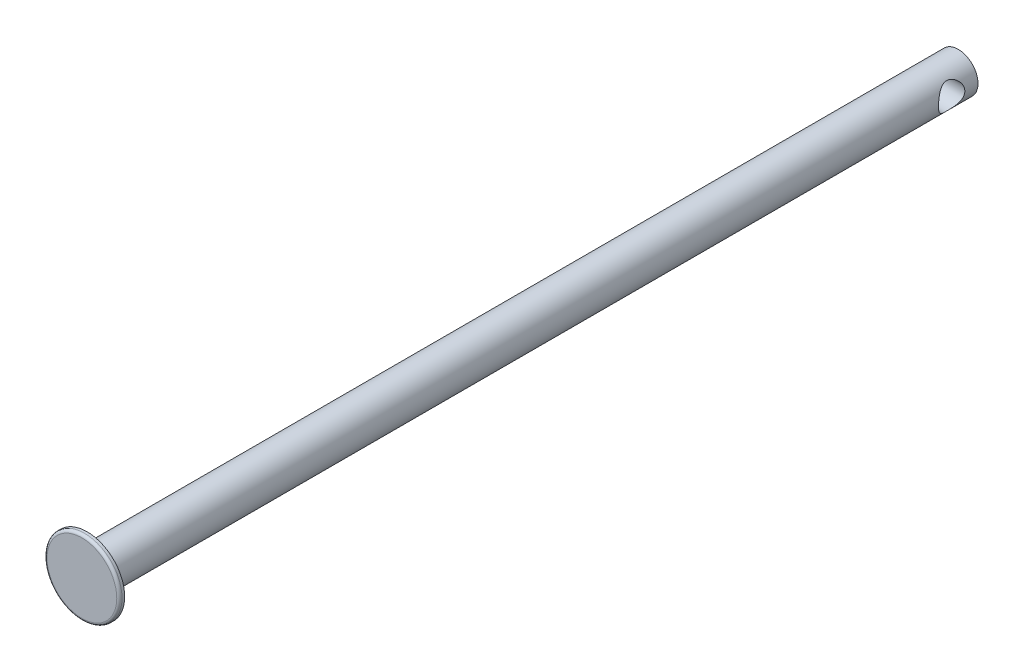
ISO-10303-21;
HEADER;
FILE_DESCRIPTION(('STEP AP214'),'2;1');
FILE_NAME('part.step','',(''),(''),'','','');
FILE_SCHEMA(('AUTOMOTIVE_DESIGN { 1 0 10303 214 1 1 1 1 }'));
ENDSEC;
DATA;
#1=APPLICATION_CONTEXT('core data for automotive mechanical design processes');
#2=APPLICATION_PROTOCOL_DEFINITION('international standard','automotive_design',2000,#1);
#3=PRODUCT_CONTEXT('',#1,'mechanical');
#4=PRODUCT('Part','Part','',(#3));
#5=PRODUCT_RELATED_PRODUCT_CATEGORY('part','',(#4));
#6=PRODUCT_DEFINITION_FORMATION('','',#4);
#7=PRODUCT_DEFINITION_CONTEXT('part definition',#1,'design');
#8=PRODUCT_DEFINITION('design','',#6,#7);
#9=PRODUCT_DEFINITION_SHAPE('','',#8);
#10=(LENGTH_UNIT() NAMED_UNIT(*) SI_UNIT(.MILLI.,.METRE.));
#11=(NAMED_UNIT(*) PLANE_ANGLE_UNIT() SI_UNIT($,.RADIAN.));
#12=(NAMED_UNIT(*) SI_UNIT($,.STERADIAN.) SOLID_ANGLE_UNIT());
#13=UNCERTAINTY_MEASURE_WITH_UNIT(LENGTH_MEASURE(1.E-05),#10,'distance_accuracy_value','');
#14=(GEOMETRIC_REPRESENTATION_CONTEXT(3) GLOBAL_UNCERTAINTY_ASSIGNED_CONTEXT((#13)) GLOBAL_UNIT_ASSIGNED_CONTEXT((#10,
#11,#12)) REPRESENTATION_CONTEXT('',''));
#15=CARTESIAN_POINT('',(0.,0.,0.));
#16=DIRECTION('',(0.,0.,1.));
#17=DIRECTION('',(1.,0.,0.));
#18=AXIS2_PLACEMENT_3D('',#15,#16,#17);
#19=CARTESIAN_POINT('',(0.,0.,331.));
#20=DIRECTION('',(0.,0.,-1.));
#21=DIRECTION('',(-1.,0.,0.));
#22=AXIS2_PLACEMENT_3D('',#19,#20,#21);
#23=CYLINDRICAL_SURFACE('',#22,7.5);
#24=CARTESIAN_POINT('',(-7.5,0.,15.));
#25=CARTESIAN_POINT('',(-7.49999996320963,-0.125608018588548,14.9999999633296));
#26=CARTESIAN_POINT('',(-7.49683780664486,-0.251216670884861,14.9952604560966));
#27=CARTESIAN_POINT('',(-7.48426887523008,-0.501407130429646,14.9763771934428));
#28=CARTESIAN_POINT('',(-7.47486206751269,-0.625988932270018,14.9622333885245));
#29=CARTESIAN_POINT('',(-7.45003382341075,-0.873171719994341,14.9247538849659));
#30=CARTESIAN_POINT('',(-7.43461128487837,-0.99577233861483,14.9014165019534));
#31=CARTESIAN_POINT('',(-7.39811136676745,-1.23813427215697,14.8458734424348));
#32=CARTESIAN_POINT('',(-7.37703158367565,-1.35789435666897,14.8136639964275));
#33=CARTESIAN_POINT('',(-7.32981525375344,-1.59314893798378,14.740986384896));
#34=CARTESIAN_POINT('',(-7.30370546494928,-1.70866231614512,14.7005618611389));
#35=CARTESIAN_POINT('',(-7.24690654349893,-1.93546860882204,14.6118121549573));
#36=CARTESIAN_POINT('',(-7.21621562725325,-2.04675985824915,14.5634838946168));
#37=CARTESIAN_POINT('',(-7.11817827260879,-2.37341381762447,14.4073874178601));
#38=CARTESIAN_POINT('',(-7.04482484943509,-2.58175996249981,14.2884437258662));
#39=CARTESIAN_POINT('',(-6.88067945428324,-2.99324442404475,14.0133484986361));
#40=CARTESIAN_POINT('',(-6.78893589581815,-3.19444057723902,13.8548960954682));
#41=CARTESIAN_POINT('',(-6.59954434905881,-3.56933031224002,13.510659108833));
#42=CARTESIAN_POINT('',(-6.5018880214744,-3.74298373794807,13.3248353662125));
#43=CARTESIAN_POINT('',(-6.34919628009922,-3.99366214280298,13.0120202439945));
#44=CARTESIAN_POINT('',(-6.29351311736736,-4.08060552383283,12.8931638517745));
#45=CARTESIAN_POINT('',(-6.18443450280949,-4.24410607449973,12.6475199343164));
#46=CARTESIAN_POINT('',(-6.13103957232405,-4.32066088576892,12.5207306176933));
#47=CARTESIAN_POINT('',(-5.97715554289977,-4.53366662201286,12.1292906259145));
#48=CARTESIAN_POINT('',(-5.88264084043698,-4.65396866792279,11.8529359675627));
#49=CARTESIAN_POINT('',(-5.74940066178898,-4.81686735383668,11.3581492370559));
#50=CARTESIAN_POINT('',(-5.70244638338744,-4.87187088253824,11.1460313437967));
#51=CARTESIAN_POINT('',(-5.64915905133327,-4.93332515657475,10.8212576931191));
#52=CARTESIAN_POINT('',(-5.63425589706967,-4.95029943249,10.7119348309963));
#53=CARTESIAN_POINT('',(-5.61069296640748,-4.97699249744458,10.4917573843738));
#54=CARTESIAN_POINT('',(-5.6020309479698,-4.98671389202271,10.3809033645204));
#55=CARTESIAN_POINT('',(-5.59128886396067,-4.99875512937179,10.1579924255082));
#56=CARTESIAN_POINT('',(-5.58923742257986,-5.00104278396599,10.0459323775791));
#57=CARTESIAN_POINT('',(-5.5918825450767,-4.9980849918467,9.82199293530448));
#58=CARTESIAN_POINT('',(-5.59657913187616,-4.99283951954458,9.71011354157399));
#59=CARTESIAN_POINT('',(-5.61252620448123,-4.97490634187683,9.48736390866386));
#60=CARTESIAN_POINT('',(-5.62378029227563,-4.96221454627213,9.37649425814924));
#61=CARTESIAN_POINT('',(-5.65238050674852,-4.92961024185719,9.15660343554882));
#62=CARTESIAN_POINT('',(-5.66972910561612,-4.90969480272766,9.04758303243614));
#63=CARTESIAN_POINT('',(-5.72818076911837,-4.84163703367357,8.73396543495533));
#64=CARTESIAN_POINT('',(-5.77653702126334,-4.78429713380928,8.53263370716592));
#65=CARTESIAN_POINT('',(-5.88774075486078,-4.64674861534595,8.14240371216595));
#66=CARTESIAN_POINT('',(-5.95059300345544,-4.56653247162609,7.9535095614946));
#67=CARTESIAN_POINT('',(-6.09910267461486,-4.36685173998334,7.55245469859576));
#68=CARTESIAN_POINT('',(-6.18679835791932,-4.24272264703471,7.34337672502797));
#69=CARTESIAN_POINT('',(-6.36729804082079,-3.96670264496564,6.94651500271284));
#70=CARTESIAN_POINT('',(-6.46010824109834,-3.81477749526626,6.75875798567564));
#71=CARTESIAN_POINT('',(-6.60779163713999,-3.54969108213473,6.47562744199996));
#72=CARTESIAN_POINT('',(-6.66328847782504,-3.44464766421748,6.37286916827723));
#73=CARTESIAN_POINT('',(-6.77217054484313,-3.22531791748826,6.17652286029991));
#74=CARTESIAN_POINT('',(-6.82555639146258,-3.11103433427816,6.0829321201714));
#75=CARTESIAN_POINT('',(-6.92883688982357,-2.87366828778323,5.90561766437411));
#76=CARTESIAN_POINT('',(-6.97873321853711,-2.75059010925358,5.82188919572972));
#77=CARTESIAN_POINT('',(-7.07374288615761,-2.49611507932344,5.66505702358697));
#78=CARTESIAN_POINT('',(-7.11885767470596,-2.36472076856899,5.59195009740016));
#79=CARTESIAN_POINT('',(-7.1947926112122,-2.12083178608807,5.47044996289298));
#80=CARTESIAN_POINT('',(-7.22668145195663,-2.00967972723592,5.42002125669251));
#81=CARTESIAN_POINT('',(-7.2859316600916,-1.78295269143193,5.32709058125619));
#82=CARTESIAN_POINT('',(-7.31329394408637,-1.66737861576612,5.28458700700019));
#83=CARTESIAN_POINT('',(-7.36291212748662,-1.43245611415625,5.20799354016269));
#84=CARTESIAN_POINT('',(-7.38517017742725,-1.31310930196114,5.17390010373021));
#85=CARTESIAN_POINT('',(-7.42408961793734,-1.07138735730615,5.11455132324583));
#86=CARTESIAN_POINT('',(-7.44075325872844,-0.949013463736589,5.08929242553385));
#87=CARTESIAN_POINT('',(-7.4681644674329,-0.701493288803488,5.04785667958248));
#88=CARTESIAN_POINT('',(-7.4788845658993,-0.576336870259728,5.03172199424734));
#89=CARTESIAN_POINT('',(-7.4940239148013,-0.324780008160028,5.0089613438812));
#90=CARTESIAN_POINT('',(-7.49844315700379,-0.198379562978776,5.00233539127495));
#91=CARTESIAN_POINT('',(-7.50086789804063,0.0546163050195394,4.99869805583468));
#92=CARTESIAN_POINT('',(-7.49887366122603,0.18121171958537,5.00168627672324));
#93=CARTESIAN_POINT('',(-7.48852351947421,0.43354493783257,5.01722789797293));
#94=CARTESIAN_POINT('',(-7.48016788605485,0.559282777885931,5.02978089008942));
#95=CARTESIAN_POINT('',(-7.45811180800349,0.800084092730028,5.06303984244169));
#96=CARTESIAN_POINT('',(-7.44483013834048,0.915274689503113,5.08310796336747));
#97=CARTESIAN_POINT('',(-7.41323727394235,1.14332502618366,5.13107744489141));
#98=CARTESIAN_POINT('',(-7.39492437584217,1.25618396274927,5.15898145846838));
#99=CARTESIAN_POINT('',(-7.33297199401165,1.59016819827962,5.25396730111001));
#100=CARTESIAN_POINT('',(-7.28229985688257,1.80689828647146,5.33235084341318));
#101=CARTESIAN_POINT('',(-7.16240567052806,2.2366977314704,5.52163714201687));
#102=CARTESIAN_POINT('',(-7.09224590701723,2.44875011842611,5.63422210894503));
#103=CARTESIAN_POINT('',(-6.94004723718924,2.8516978970661,5.88608150005795));
#104=CARTESIAN_POINT('',(-6.85800100215921,3.04258010694991,6.02537240729556));
#105=CARTESIAN_POINT('',(-6.67386338599776,3.42963933761377,6.35152024255087));
#106=CARTESIAN_POINT('',(-6.57065384591325,3.62188054324072,6.54241580633922));
#107=CARTESIAN_POINT('',(-6.36427940129081,3.97334834714672,6.95277841863379));
#108=CARTESIAN_POINT('',(-6.26111457639159,4.13255212685989,7.17226504546276));
#109=CARTESIAN_POINT('',(-6.07349195966786,4.40311961015302,7.61785607980173));
#110=CARTESIAN_POINT('',(-5.98818993185449,4.51739093945808,7.8418301361395));
#111=CARTESIAN_POINT('',(-5.83597435045316,4.71240530724639,8.30968157872016));
#112=CARTESIAN_POINT('',(-5.76902777392137,4.79320869285462,8.55352218410378));
#113=CARTESIAN_POINT('',(-5.67333023681701,4.90589604497064,9.01141135057003));
#114=CARTESIAN_POINT('',(-5.63987506376385,4.94396476310194,9.22292997208489));
#115=CARTESIAN_POINT('',(-5.59698654785069,4.99248032394649,9.65143275638778));
#116=CARTESIAN_POINT('',(-5.58752711368552,5.00295716862677,9.8684107234815));
#117=CARTESIAN_POINT('',(-5.59410544900805,4.99559738764621,10.3016092971559));
#118=CARTESIAN_POINT('',(-5.61015831597501,4.97774399693959,10.5178293793433));
#119=CARTESIAN_POINT('',(-5.66525973970472,4.91492740617482,10.9433526371748));
#120=CARTESIAN_POINT('',(-5.7043389738479,4.8699280383881,11.1526461911937));
#121=CARTESIAN_POINT('',(-5.81317852459072,4.73981418276008,11.61430721309));
#122=CARTESIAN_POINT('',(-5.88833948649797,4.64720557432273,11.8632919373739));
#123=CARTESIAN_POINT('',(-6.0137282216154,4.48217153169634,12.2197721527126));
#124=CARTESIAN_POINT('',(-6.05768608443999,4.4227291606703,12.335880981227));
#125=CARTESIAN_POINT('',(-6.14853438480218,4.29553797555822,12.5622633756569));
#126=CARTESIAN_POINT('',(-6.19542487694525,4.22778900678103,12.6725368328473));
#127=CARTESIAN_POINT('',(-6.34038233699541,4.0100125161287,12.9981315727327));
#128=CARTESIAN_POINT('',(-6.44119239434724,3.84739387541878,13.2040649889025));
#129=CARTESIAN_POINT('',(-6.5908294854328,3.58070368138863,13.4922362304797));
#130=CARTESIAN_POINT('',(-6.64046727146307,3.48796686520542,13.5848751310009));
#131=CARTESIAN_POINT('',(-6.73828470699058,3.29502624182907,13.7629820060506));
#132=CARTESIAN_POINT('',(-6.78646402214188,3.19482074044039,13.8484483441512));
#133=CARTESIAN_POINT('',(-6.88712610322217,2.97228582382091,14.023473858393));
#134=CARTESIAN_POINT('',(-6.93922872778526,2.84884898400046,14.11184847541));
#135=CARTESIAN_POINT('',(-7.03877400576411,2.59315796105783,14.2777021931871));
#136=CARTESIAN_POINT('',(-7.08621876519301,2.46090780863046,14.3551862249349));
#137=CARTESIAN_POINT('',(-7.17506685821064,2.18836443414477,14.4983027842769));
#138=CARTESIAN_POINT('',(-7.21647581452225,2.04807886951547,14.5639463557069));
#139=CARTESIAN_POINT('',(-7.29200187013099,1.76034275764725,14.6824542804441));
#140=CARTESIAN_POINT('',(-7.32612152964091,1.61289474847382,14.7353231214655));
#141=CARTESIAN_POINT('',(-7.37927647812224,1.3455542833391,14.8171003282155));
#142=CARTESIAN_POINT('',(-7.39997893582426,1.22681585673932,14.8487223889298));
#143=CARTESIAN_POINT('',(-7.43582405760531,0.986541218916692,14.9032543573003));
#144=CARTESIAN_POINT('',(-7.45096786434905,0.865005588166446,14.9261660555379));
#145=CARTESIAN_POINT('',(-7.47533722218222,0.620058880061067,14.962948340237));
#146=CARTESIAN_POINT('',(-7.48456629083545,0.496648962158437,14.9768243004365));
#147=CARTESIAN_POINT('',(-7.49689781286771,0.248826261701849,14.9953503215082));
#148=CARTESIAN_POINT('',(-7.50000003644048,0.124413441706679,15.0000000363217));
#149=CARTESIAN_POINT('',(-7.5,0.,15.));
#150=B_SPLINE_CURVE_WITH_KNOTS('',3,(#24,#25,#26,#27,#28,#29,#30,#31,#32,#33,#34,#35,#36,#37,
#38,#39,#40,#41,#42,#43,#44,#45,#46,#47,#48,#49,#50,#51,#52,#53,#54,#55,#56,#57,#58,#59,#60,#61,
#62,#63,#64,#65,#66,#67,#68,#69,#70,#71,#72,#73,#74,#75,#76,#77,#78,#79,#80,#81,#82,#83,#84,#85,
#86,#87,#88,#89,#90,#91,#92,#93,#94,#95,#96,#97,#98,#99,#100,#101,#102,#103,#104,#105,#106,#107,
#108,#109,#110,#111,#112,#113,#114,#115,#116,#117,#118,#119,#120,#121,#122,#123,#124,#125,#126,
#127,#128,#129,#130,#131,#132,#133,#134,#135,#136,#137,#138,#139,#140,#141,#142,#143,#144,#145,
#146,#147,#148,#149),.UNSPECIFIED.,.T.,.F.,(4,2,2,2,2,2,2,2,2,2,2,2,2,2,2,2,2,2,2,2,2,2,2,2,2,2,
2,2,2,2,2,2,2,2,2,2,2,2,2,2,2,2,2,2,2,2,2,2,2,2,2,2,2,2,2,2,2,2,2,2,2,2,4),(0.,
0.376697150092868,0.7533962828654,1.13016446348966,1.5070929703719,1.88206910413628,
2.2571916123895,3.00679232609858,3.82000195441008,4.63438651949459,5.10618372652057,
5.57808786035318,6.5193034140896,7.18876311985435,7.52328813363274,7.85769291407032,
8.19354375486223,8.52939573647986,8.86543237335315,9.20160547846822,9.84356710192613,
10.4857401421745,11.2585349135694,12.032288141549,12.5030398312138,12.9736521532471,
13.44403673454,13.9142782967794,14.2923626335413,14.6703703162267,15.0482184414745,
15.4259144034603,15.8053417246618,16.184769541648,16.5641817195628,16.9435777042718,
17.2962009039366,17.6489436346054,18.3538353932503,19.1014251855315,19.8494778884236,
20.7158209183258,21.5827603441875,22.3763648974054,23.1685321808116,23.8182177151969,
24.4671965231208,25.1165595219072,25.7667896111035,26.5902817323984,27.0029102138176,
27.4155463806554,28.2552096763187,28.6754157798874,29.0957174947647,29.5765774176914,
30.0572189128906,30.5374097593981,31.0174316706402,31.3908313299587,31.7641541882901,
32.1372548206283,32.5103694469936),.UNSPECIFIED.);
#151=CARTESIAN_POINT('',(-7.5,0.,15.));
#152=VERTEX_POINT('',#151);
#153=EDGE_CURVE('E37',#152,#152,#150,.T.);
#154=ORIENTED_EDGE('',*,*,#153,.T.);
#155=EDGE_LOOP('',(#154));
#156=FACE_BOUND('',#155,.T.);
#157=CARTESIAN_POINT('',(7.5,0.,5.));
#158=CARTESIAN_POINT('',(7.49999996320963,-0.125608018588548,5.00000003667042));
#159=CARTESIAN_POINT('',(7.49683780664486,-0.251216670884861,5.00473954390344));
#160=CARTESIAN_POINT('',(7.48426887523008,-0.501407130429646,5.02362280655722));
#161=CARTESIAN_POINT('',(7.47486206751269,-0.625988932270019,5.03776661147546));
#162=CARTESIAN_POINT('',(7.45003382341075,-0.873171719994341,5.07524611503412));
#163=CARTESIAN_POINT('',(7.43461128487837,-0.99577233861483,5.09858349804664));
#164=CARTESIAN_POINT('',(7.39811136676745,-1.23813427215697,5.15412655756518));
#165=CARTESIAN_POINT('',(7.37703158367565,-1.35789435666897,5.1863360035725));
#166=CARTESIAN_POINT('',(7.32981525375344,-1.59314893798378,5.25901361510399));
#167=CARTESIAN_POINT('',(7.30370546494928,-1.70866231614512,5.29943813886113));
#168=CARTESIAN_POINT('',(7.24690654349893,-1.93546860882204,5.38818784504269));
#169=CARTESIAN_POINT('',(7.21621562725325,-2.04675985824914,5.43651610538324));
#170=CARTESIAN_POINT('',(7.11817827260879,-2.37341381762447,5.59261258213989));
#171=CARTESIAN_POINT('',(7.04482484943509,-2.58175996249981,5.71155627413384));
#172=CARTESIAN_POINT('',(6.88067945428324,-2.99324442404475,5.98665150136388));
#173=CARTESIAN_POINT('',(6.78893589581815,-3.19444057723902,6.14510390453178));
#174=CARTESIAN_POINT('',(6.59954434905881,-3.56933031224002,6.48934089116697));
#175=CARTESIAN_POINT('',(6.5018880214744,-3.74298373794807,6.67516463378748));
#176=CARTESIAN_POINT('',(6.34919628009922,-3.99366214280298,6.98797975600547));
#177=CARTESIAN_POINT('',(6.29351311736736,-4.08060552383283,7.10683614822547));
#178=CARTESIAN_POINT('',(6.18443450280949,-4.24410607449973,7.3524800656836));
#179=CARTESIAN_POINT('',(6.13103957232405,-4.32066088576891,7.47926938230667));
#180=CARTESIAN_POINT('',(5.97715554289977,-4.53366662201286,7.8707093740855));
#181=CARTESIAN_POINT('',(5.88264084043698,-4.65396866792279,8.14706403243729));
#182=CARTESIAN_POINT('',(5.74940066178898,-4.81686735383668,8.6418507629441));
#183=CARTESIAN_POINT('',(5.70244638338744,-4.87187088253824,8.8539686562033));
#184=CARTESIAN_POINT('',(5.64915905133327,-4.93332515657475,9.1787423068809));
#185=CARTESIAN_POINT('',(5.63425589706967,-4.95029943249,9.2880651690037));
#186=CARTESIAN_POINT('',(5.61069296640748,-4.97699249744458,9.50824261562624));
#187=CARTESIAN_POINT('',(5.6020309479698,-4.98671389202271,9.61909663547959));
#188=CARTESIAN_POINT('',(5.59128886396067,-4.99875512937179,9.84200757449176));
#189=CARTESIAN_POINT('',(5.58923742257986,-5.00104278396599,9.95406762242092));
#190=CARTESIAN_POINT('',(5.5918825450767,-4.9980849918467,10.1780070646955));
#191=CARTESIAN_POINT('',(5.59657913187616,-4.99283951954458,10.289886458426));
#192=CARTESIAN_POINT('',(5.61252620448123,-4.97490634187683,10.5126360913361));
#193=CARTESIAN_POINT('',(5.62378029227563,-4.96221454627213,10.6235057418508));
#194=CARTESIAN_POINT('',(5.65238050674852,-4.92961024185719,10.8433965644512));
#195=CARTESIAN_POINT('',(5.66972910561612,-4.90969480272766,10.9524169675639));
#196=CARTESIAN_POINT('',(5.72818076911837,-4.84163703367357,11.2660345650447));
#197=CARTESIAN_POINT('',(5.77653702126334,-4.78429713380928,11.4673662928341));
#198=CARTESIAN_POINT('',(5.88774075486078,-4.64674861534595,11.8575962878341));
#199=CARTESIAN_POINT('',(5.95059300345545,-4.56653247162609,12.0464904385054));
#200=CARTESIAN_POINT('',(6.09910267461486,-4.36685173998334,12.4475453014042));
#201=CARTESIAN_POINT('',(6.18679835791932,-4.24272264703471,12.656623274972));
#202=CARTESIAN_POINT('',(6.36729804082079,-3.96670264496564,13.0534849972872));
#203=CARTESIAN_POINT('',(6.46010824109834,-3.81477749526626,13.2412420143244));
#204=CARTESIAN_POINT('',(6.60779163713999,-3.54969108213473,13.524372558));
#205=CARTESIAN_POINT('',(6.66328847782504,-3.44464766421749,13.6271308317228));
#206=CARTESIAN_POINT('',(6.77217054484313,-3.22531791748826,13.8234771397001));
#207=CARTESIAN_POINT('',(6.82555639146258,-3.11103433427816,13.9170678798286));
#208=CARTESIAN_POINT('',(6.92883688982357,-2.87366828778323,14.0943823356259));
#209=CARTESIAN_POINT('',(6.97873321853711,-2.75059010925358,14.1781108042703));
#210=CARTESIAN_POINT('',(7.07374288615761,-2.49611507932344,14.334942976413));
#211=CARTESIAN_POINT('',(7.11885767470596,-2.36472076856899,14.4080499025998));
#212=CARTESIAN_POINT('',(7.1947926112122,-2.12083178608807,14.529550037107));
#213=CARTESIAN_POINT('',(7.22668145195663,-2.00967972723592,14.5799787433075));
#214=CARTESIAN_POINT('',(7.2859316600916,-1.78295269143193,14.6729094187438));
#215=CARTESIAN_POINT('',(7.31329394408637,-1.66737861576612,14.7154129929998));
#216=CARTESIAN_POINT('',(7.36291212748662,-1.43245611415626,14.7920064598373));
#217=CARTESIAN_POINT('',(7.38517017742725,-1.31310930196114,14.8260998962698));
#218=CARTESIAN_POINT('',(7.42408961793734,-1.07138735730615,14.8854486767542));
#219=CARTESIAN_POINT('',(7.44075325872844,-0.949013463736589,14.9107075744661));
#220=CARTESIAN_POINT('',(7.4681644674329,-0.701493288803487,14.9521433204175));
#221=CARTESIAN_POINT('',(7.4788845658993,-0.576336870259727,14.9682780057527));
#222=CARTESIAN_POINT('',(7.4940239148013,-0.324780008160026,14.9910386561188));
#223=CARTESIAN_POINT('',(7.49844315700379,-0.198379562978774,14.9976646087251));
#224=CARTESIAN_POINT('',(7.50086789804063,0.0546163050195415,15.0013019441653));
#225=CARTESIAN_POINT('',(7.49887366122603,0.181211719585372,14.9983137232768));
#226=CARTESIAN_POINT('',(7.48852351947421,0.433544937832572,14.9827721020271));
#227=CARTESIAN_POINT('',(7.48016788605485,0.559282777885933,14.9702191099106));
#228=CARTESIAN_POINT('',(7.45811180800349,0.800084092730028,14.9369601575583));
#229=CARTESIAN_POINT('',(7.44483013834048,0.915274689503112,14.9168920366325));
#230=CARTESIAN_POINT('',(7.41323727394235,1.14332502618366,14.8689225551086));
#231=CARTESIAN_POINT('',(7.39492437584217,1.25618396274927,14.8410185415316));
#232=CARTESIAN_POINT('',(7.33297199401165,1.59016819827962,14.74603269889));
#233=CARTESIAN_POINT('',(7.28229985688257,1.80689828647146,14.6676491565868));
#234=CARTESIAN_POINT('',(7.16240567052806,2.2366977314704,14.4783628579831));
#235=CARTESIAN_POINT('',(7.09224590701723,2.44875011842611,14.365777891055));
#236=CARTESIAN_POINT('',(6.94004723718924,2.85169789706611,14.113918499942));
#237=CARTESIAN_POINT('',(6.85800100215921,3.04258010694991,13.9746275927044));
#238=CARTESIAN_POINT('',(6.67386338599776,3.42963933761377,13.6484797574491));
#239=CARTESIAN_POINT('',(6.57065384591325,3.62188054324072,13.4575841936608));
#240=CARTESIAN_POINT('',(6.36427940129081,3.97334834714672,13.0472215813662));
#241=CARTESIAN_POINT('',(6.26111457639159,4.13255212685989,12.8277349545372));
#242=CARTESIAN_POINT('',(6.07349195966786,4.40311961015303,12.3821439201983));
#243=CARTESIAN_POINT('',(5.98818993185448,4.51739093945808,12.1581698638605));
#244=CARTESIAN_POINT('',(5.83597435045316,4.71240530724639,11.6903184212798));
#245=CARTESIAN_POINT('',(5.76902777392137,4.79320869285462,11.4464778158962));
#246=CARTESIAN_POINT('',(5.67333023681701,4.90589604497064,10.98858864943));
#247=CARTESIAN_POINT('',(5.63987506376385,4.94396476310194,10.7770700279151));
#248=CARTESIAN_POINT('',(5.59698654785069,4.99248032394649,10.3485672436122));
#249=CARTESIAN_POINT('',(5.58752711368552,5.00295716862677,10.1315892765185));
#250=CARTESIAN_POINT('',(5.59410544900805,4.99559738764621,9.69839070284415));
#251=CARTESIAN_POINT('',(5.61015831597501,4.97774399693959,9.48217062065674));
#252=CARTESIAN_POINT('',(5.66525973970472,4.91492740617482,9.05664736282524));
#253=CARTESIAN_POINT('',(5.7043389738479,4.8699280383881,8.84735380880633));
#254=CARTESIAN_POINT('',(5.81317852459072,4.73981418276009,8.38569278691));
#255=CARTESIAN_POINT('',(5.88833948649796,4.64720557432273,8.13670806262607));
#256=CARTESIAN_POINT('',(6.0137282216154,4.48217153169634,7.7802278472874));
#257=CARTESIAN_POINT('',(6.05768608443999,4.4227291606703,7.66411901877296));
#258=CARTESIAN_POINT('',(6.14853438480218,4.29553797555823,7.4377366243431));
#259=CARTESIAN_POINT('',(6.19542487694525,4.22778900678103,7.32746316715273));
#260=CARTESIAN_POINT('',(6.34038233699541,4.0100125161287,7.00186842726726));
#261=CARTESIAN_POINT('',(6.44119239434723,3.84739387541879,6.79593501109754));
#262=CARTESIAN_POINT('',(6.5908294854328,3.58070368138863,6.50776376952032));
#263=CARTESIAN_POINT('',(6.64046727146307,3.48796686520542,6.4151248689991));
#264=CARTESIAN_POINT('',(6.73828470699057,3.29502624182907,6.23701799394943));
#265=CARTESIAN_POINT('',(6.78646402214188,3.19482074044039,6.15155165584881));
#266=CARTESIAN_POINT('',(6.88712610322217,2.97228582382091,5.97652614160701));
#267=CARTESIAN_POINT('',(6.93922872778526,2.84884898400047,5.88815152459003));
#268=CARTESIAN_POINT('',(7.03877400576411,2.59315796105783,5.72229780681295));
#269=CARTESIAN_POINT('',(7.08621876519301,2.46090780863046,5.64481377506514));
#270=CARTESIAN_POINT('',(7.17506685821064,2.18836443414477,5.50169721572307));
#271=CARTESIAN_POINT('',(7.21647581452224,2.04807886951547,5.43605364429309));
#272=CARTESIAN_POINT('',(7.29200187013099,1.76034275764725,5.31754571955586));
#273=CARTESIAN_POINT('',(7.32612152964091,1.61289474847383,5.26467687853453));
#274=CARTESIAN_POINT('',(7.37927647812224,1.34555428333911,5.18289967178453));
#275=CARTESIAN_POINT('',(7.39997893582426,1.22681585673933,5.15127761107023));
#276=CARTESIAN_POINT('',(7.43582405760531,0.986541218916702,5.09674564269966));
#277=CARTESIAN_POINT('',(7.45096786434905,0.865005588166456,5.0738339444621));
#278=CARTESIAN_POINT('',(7.47533722218222,0.620058880061074,5.03705165976301));
#279=CARTESIAN_POINT('',(7.48456629083545,0.496648962158442,5.02317569956354));
#280=CARTESIAN_POINT('',(7.49689781286771,0.24882626170185,5.00464967849178));
#281=CARTESIAN_POINT('',(7.50000003644048,0.12441344170668,4.99999996367834));
#282=CARTESIAN_POINT('',(7.5,0.,5.));
#283=B_SPLINE_CURVE_WITH_KNOTS('',3,(#157,#158,#159,#160,#161,#162,#163,#164,#165,#166,#167,
#168,#169,#170,#171,#172,#173,#174,#175,#176,#177,#178,#179,#180,#181,#182,#183,#184,#185,#186,
#187,#188,#189,#190,#191,#192,#193,#194,#195,#196,#197,#198,#199,#200,#201,#202,#203,#204,#205,
#206,#207,#208,#209,#210,#211,#212,#213,#214,#215,#216,#217,#218,#219,#220,#221,#222,#223,#224,
#225,#226,#227,#228,#229,#230,#231,#232,#233,#234,#235,#236,#237,#238,#239,#240,#241,#242,#243,
#244,#245,#246,#247,#248,#249,#250,#251,#252,#253,#254,#255,#256,#257,#258,#259,#260,#261,#262,
#263,#264,#265,#266,#267,#268,#269,#270,#271,#272,#273,#274,#275,#276,#277,#278,#279,#280,#281,
#282),.UNSPECIFIED.,.T.,.F.,(4,2,2,2,2,2,2,2,2,2,2,2,2,2,2,2,2,2,2,2,2,2,2,2,2,2,2,2,2,2,2,2,2,
2,2,2,2,2,2,2,2,2,2,2,2,2,2,2,2,2,2,2,2,2,2,2,2,2,2,2,2,2,4),(0.,0.376697150092868,
0.7533962828654,1.13016446348966,1.5070929703719,1.88206910413628,2.2571916123895,
3.00679232609858,3.82000195441008,4.63438651949459,5.10618372652056,5.57808786035318,
6.5193034140896,7.18876311985435,7.52328813363274,7.85769291407032,8.19354375486223,
8.52939573647986,8.86543237335315,9.20160547846822,9.84356710192613,10.4857401421745,
11.2585349135694,12.032288141549,12.5030398312138,12.9736521532471,13.44403673454,
13.9142782967795,14.2923626335413,14.6703703162267,15.0482184414745,15.4259144034603,
15.8053417246619,16.184769541648,16.5641817195628,16.9435777042718,17.2962009039366,
17.6489436346054,18.3538353932503,19.1014251855315,19.8494778884236,20.7158209183258,
21.5827603441875,22.3763648974054,23.1685321808116,23.8182177151969,24.4671965231208,
25.1165595219072,25.7667896111035,26.5902817323984,27.0029102138176,27.4155463806554,
28.2552096763187,28.6754157798874,29.0957174947647,29.5765774176914,30.0572189128906,
30.5374097593981,31.0174316706402,31.3908313299587,31.7641541882901,32.1372548206283,
32.5103694469936),.UNSPECIFIED.);
#284=CARTESIAN_POINT('',(7.5,0.,5.));
#285=VERTEX_POINT('',#284);
#286=EDGE_CURVE('E53',#285,#285,#283,.T.);
#287=ORIENTED_EDGE('',*,*,#286,.T.);
#288=EDGE_LOOP('',(#287));
#289=FACE_BOUND('',#288,.T.);
#290=CARTESIAN_POINT('',(0.,0.,331.));
#291=DIRECTION('',(0.,0.,1.));
#292=DIRECTION('',(1.,0.,0.));
#293=AXIS2_PLACEMENT_3D('',#290,#291,#292);
#294=CIRCLE('',#293,7.5);
#295=CARTESIAN_POINT('',(7.5,0.,331.));
#296=VERTEX_POINT('',#295);
#297=EDGE_CURVE('E50',#296,#296,#294,.T.);
#298=ORIENTED_EDGE('',*,*,#297,.F.);
#299=EDGE_LOOP('',(#298));
#300=FACE_BOUND('',#299,.T.);
#301=CARTESIAN_POINT('',(0.,0.,0.));
#302=DIRECTION('',(0.,0.,1.));
#303=DIRECTION('',(1.,0.,0.));
#304=AXIS2_PLACEMENT_3D('',#301,#302,#303);
#305=CIRCLE('',#304,7.5);
#306=CARTESIAN_POINT('',(7.5,0.,0.));
#307=VERTEX_POINT('',#306);
#308=EDGE_CURVE('E85',#307,#307,#305,.T.);
#309=ORIENTED_EDGE('',*,*,#308,.T.);
#310=EDGE_LOOP('',(#309));
#311=FACE_BOUND('',#310,.T.);
#312=ADVANCED_FACE('F33',(#156,#289,#300,#311),#23,.T.);
#313=CARTESIAN_POINT('',(0.,0.,0.));
#314=DIRECTION('',(0.,0.,1.));
#315=DIRECTION('',(1.,0.,0.));
#316=AXIS2_PLACEMENT_3D('',#313,#314,#315);
#317=PLANE('',#316);
#318=ORIENTED_EDGE('',*,*,#308,.F.);
#319=EDGE_LOOP('',(#318));
#320=FACE_BOUND('',#319,.T.);
#321=ADVANCED_FACE('F76',(#320),#317,.F.);
#322=CARTESIAN_POINT('',(0.,0.,333.));
#323=DIRECTION('',(0.,0.,-1.));
#324=DIRECTION('',(-1.,0.,0.));
#325=AXIS2_PLACEMENT_3D('',#322,#323,#324);
#326=CYLINDRICAL_SURFACE('',#325,14.25);
#327=CARTESIAN_POINT('',(0.,0.,332.));
#328=DIRECTION('',(0.,0.,1.));
#329=DIRECTION('',(1.,0.,0.));
#330=AXIS2_PLACEMENT_3D('',#327,#328,#329);
#331=CIRCLE('',#330,14.25);
#332=CARTESIAN_POINT('',(14.25,0.,332.));
#333=VERTEX_POINT('',#332);
#334=EDGE_CURVE('E10',#333,#333,#331,.F.);
#335=ORIENTED_EDGE('',*,*,#334,.T.);
#336=EDGE_LOOP('',(#335));
#337=FACE_BOUND('',#336,.T.);
#338=CARTESIAN_POINT('',(0.,0.,331.));
#339=DIRECTION('',(0.,0.,1.));
#340=DIRECTION('',(1.,0.,0.));
#341=AXIS2_PLACEMENT_3D('',#338,#339,#340);
#342=CIRCLE('',#341,14.25);
#343=CARTESIAN_POINT('',(14.25,0.,331.));
#344=VERTEX_POINT('',#343);
#345=EDGE_CURVE('E87',#344,#344,#342,.T.);
#346=ORIENTED_EDGE('',*,*,#345,.T.);
#347=EDGE_LOOP('',(#346));
#348=FACE_BOUND('',#347,.T.);
#349=ADVANCED_FACE('F70',(#337,#348),#326,.T.);
#350=CARTESIAN_POINT('',(0.,0.,333.));
#351=DIRECTION('',(0.,0.,1.));
#352=DIRECTION('',(1.,0.,0.));
#353=AXIS2_PLACEMENT_3D('',#350,#351,#352);
#354=PLANE('',#353);
#355=CARTESIAN_POINT('',(0.,0.,333.));
#356=DIRECTION('',(0.,0.,1.));
#357=DIRECTION('',(1.,0.,0.));
#358=AXIS2_PLACEMENT_3D('',#355,#356,#357);
#359=CIRCLE('',#358,13.25);
#360=CARTESIAN_POINT('',(13.25,0.,333.));
#361=VERTEX_POINT('',#360);
#362=EDGE_CURVE('E45',#361,#361,#359,.T.);
#363=ORIENTED_EDGE('',*,*,#362,.T.);
#364=EDGE_LOOP('',(#363));
#365=FACE_BOUND('',#364,.T.);
#366=ADVANCED_FACE('F65',(#365),#354,.T.);
#367=CARTESIAN_POINT('',(0.,0.,331.));
#368=DIRECTION('',(0.,0.,1.));
#369=DIRECTION('',(1.,0.,0.));
#370=AXIS2_PLACEMENT_3D('',#367,#368,#369);
#371=PLANE('',#370);
#372=ORIENTED_EDGE('',*,*,#297,.T.);
#373=EDGE_LOOP('',(#372));
#374=FACE_BOUND('',#373,.T.);
#375=ORIENTED_EDGE('',*,*,#345,.F.);
#376=EDGE_LOOP('',(#375));
#377=FACE_BOUND('',#376,.T.);
#378=ADVANCED_FACE('F69',(#374,#377),#371,.F.);
#379=CARTESIAN_POINT('',(0.,0.,332.));
#380=DIRECTION('',(0.,0.,1.));
#381=DIRECTION('',(1.,0.,0.));
#382=AXIS2_PLACEMENT_3D('',#379,#380,#381);
#383=TOROIDAL_SURFACE('',#382,13.25,1.);
#384=ORIENTED_EDGE('',*,*,#334,.F.);
#385=EDGE_LOOP('',(#384));
#386=FACE_BOUND('',#385,.T.);
#387=ORIENTED_EDGE('',*,*,#362,.F.);
#388=EDGE_LOOP('',(#387));
#389=FACE_BOUND('',#388,.T.);
#390=ADVANCED_FACE('F35',(#386,#389),#383,.T.);
#391=CARTESIAN_POINT('',(-22.,0.,10.));
#392=DIRECTION('',(1.,0.,0.));
#393=DIRECTION('',(0.,0.,-1.));
#394=AXIS2_PLACEMENT_3D('',#391,#392,#393);
#395=CYLINDRICAL_SURFACE('',#394,5.);
#396=ORIENTED_EDGE('',*,*,#286,.F.);
#397=EDGE_LOOP('',(#396));
#398=FACE_BOUND('',#397,.T.);
#399=ORIENTED_EDGE('',*,*,#153,.F.);
#400=EDGE_LOOP('',(#399));
#401=FACE_BOUND('',#400,.T.);
#402=ADVANCED_FACE('F60',(#398,#401),#395,.F.);
#403=CLOSED_SHELL('',(#312,#321,#349,#366,#378,#390,#402));
#404=MANIFOLD_SOLID_BREP('B2',#403);
#405=ADVANCED_BREP_SHAPE_REPRESENTATION('',(#18,#404),#14);
#406=SHAPE_DEFINITION_REPRESENTATION(#9,#405);
ENDSEC;
END-ISO-10303-21;
